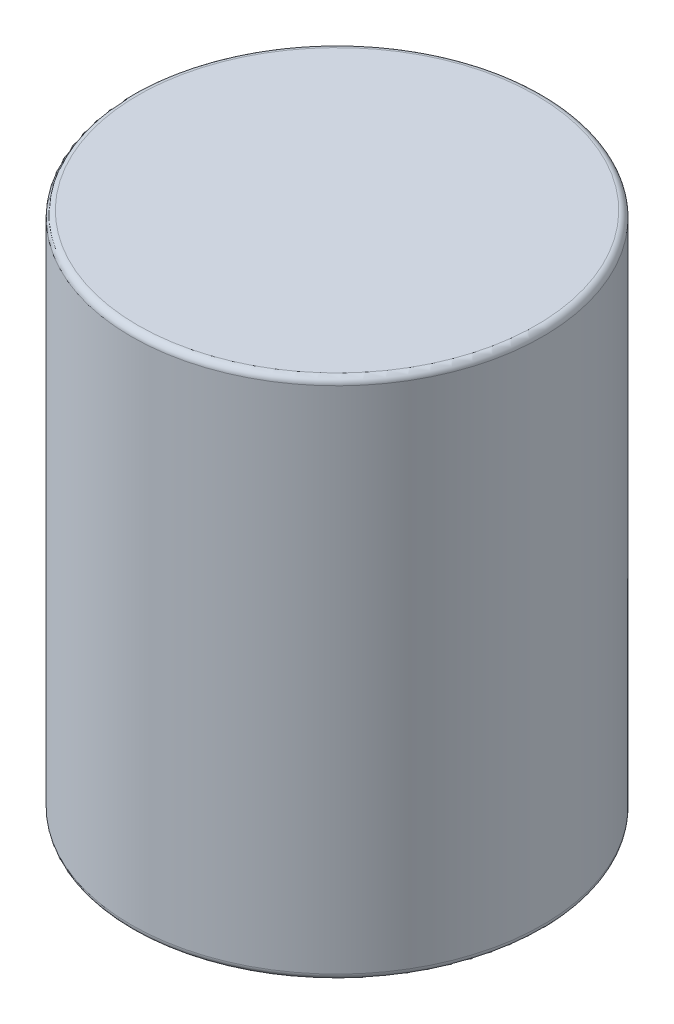
ISO-10303-21;
HEADER;
FILE_DESCRIPTION(('STEP AP214'),'2;1');
FILE_NAME('part.step','',(''),(''),'','','');
FILE_SCHEMA(('AUTOMOTIVE_DESIGN { 1 0 10303 214 1 1 1 1 }'));
ENDSEC;
DATA;
#1=APPLICATION_CONTEXT('core data for automotive mechanical design processes');
#2=APPLICATION_PROTOCOL_DEFINITION('international standard','automotive_design',2000,#1);
#3=PRODUCT_CONTEXT('',#1,'mechanical');
#4=PRODUCT('Part','Part','',(#3));
#5=PRODUCT_RELATED_PRODUCT_CATEGORY('part','',(#4));
#6=PRODUCT_DEFINITION_FORMATION('','',#4);
#7=PRODUCT_DEFINITION_CONTEXT('part definition',#1,'design');
#8=PRODUCT_DEFINITION('design','',#6,#7);
#9=PRODUCT_DEFINITION_SHAPE('','',#8);
#10=(LENGTH_UNIT() NAMED_UNIT(*) SI_UNIT(.MILLI.,.METRE.));
#11=(NAMED_UNIT(*) PLANE_ANGLE_UNIT() SI_UNIT($,.RADIAN.));
#12=(NAMED_UNIT(*) SI_UNIT($,.STERADIAN.) SOLID_ANGLE_UNIT());
#13=UNCERTAINTY_MEASURE_WITH_UNIT(LENGTH_MEASURE(1.E-05),#10,'distance_accuracy_value','');
#14=(GEOMETRIC_REPRESENTATION_CONTEXT(3) GLOBAL_UNCERTAINTY_ASSIGNED_CONTEXT((#13)) GLOBAL_UNIT_ASSIGNED_CONTEXT((#10,
#11,#12)) REPRESENTATION_CONTEXT('',''));
#15=CARTESIAN_POINT('',(0.,0.,0.));
#16=DIRECTION('',(0.,0.,1.));
#17=DIRECTION('',(1.,0.,0.));
#18=AXIS2_PLACEMENT_3D('',#15,#16,#17);
#19=CARTESIAN_POINT('',(0.,8.,0.));
#20=DIRECTION('',(0.,-1.,0.));
#21=DIRECTION('',(0.,0.,-1.));
#22=AXIS2_PLACEMENT_3D('',#19,#20,#21);
#23=CYLINDRICAL_SURFACE('',#22,3.15);
#24=CARTESIAN_POINT('',(0.,0.0999999999999994,0.));
#25=DIRECTION('',(0.,1.,0.));
#26=DIRECTION('',(0.,0.,1.));
#27=AXIS2_PLACEMENT_3D('',#24,#25,#26);
#28=CIRCLE('',#27,3.15);
#29=CARTESIAN_POINT('',(0.,0.0999999999999994,3.15));
#30=VERTEX_POINT('',#29);
#31=EDGE_CURVE('E42',#30,#30,#28,.T.);
#32=ORIENTED_EDGE('',*,*,#31,.T.);
#33=EDGE_LOOP('',(#32));
#34=FACE_BOUND('',#33,.T.);
#35=CARTESIAN_POINT('',(0.,7.9,0.));
#36=DIRECTION('',(0.,1.,0.));
#37=DIRECTION('',(0.,0.,1.));
#38=AXIS2_PLACEMENT_3D('',#35,#36,#37);
#39=CIRCLE('',#38,3.15);
#40=CARTESIAN_POINT('',(0.,7.9,3.15));
#41=VERTEX_POINT('',#40);
#42=EDGE_CURVE('E46',#41,#41,#39,.F.);
#43=ORIENTED_EDGE('',*,*,#42,.T.);
#44=EDGE_LOOP('',(#43));
#45=FACE_BOUND('',#44,.T.);
#46=ADVANCED_FACE('F35',(#34,#45),#23,.T.);
#47=CARTESIAN_POINT('',(0.,8.,0.));
#48=DIRECTION('',(0.,1.,0.));
#49=DIRECTION('',(0.,0.,1.));
#50=AXIS2_PLACEMENT_3D('',#47,#48,#49);
#51=PLANE('',#50);
#52=CARTESIAN_POINT('',(0.,8.,0.));
#53=DIRECTION('',(0.,1.,0.));
#54=DIRECTION('',(0.,0.,1.));
#55=AXIS2_PLACEMENT_3D('',#52,#53,#54);
#56=CIRCLE('',#55,3.05);
#57=CARTESIAN_POINT('',(0.,8.,3.05));
#58=VERTEX_POINT('',#57);
#59=EDGE_CURVE('E50',#58,#58,#56,.T.);
#60=ORIENTED_EDGE('',*,*,#59,.T.);
#61=EDGE_LOOP('',(#60));
#62=FACE_BOUND('',#61,.T.);
#63=ADVANCED_FACE('F56',(#62),#51,.T.);
#64=CARTESIAN_POINT('',(0.,0.,0.));
#65=DIRECTION('',(0.,1.,0.));
#66=DIRECTION('',(0.,0.,1.));
#67=AXIS2_PLACEMENT_3D('',#64,#65,#66);
#68=PLANE('',#67);
#69=CARTESIAN_POINT('',(0.,0.,0.));
#70=DIRECTION('',(0.,1.,0.));
#71=DIRECTION('',(0.,0.,1.));
#72=AXIS2_PLACEMENT_3D('',#69,#70,#71);
#73=CIRCLE('',#72,3.05);
#74=CARTESIAN_POINT('',(0.,0.,3.05));
#75=VERTEX_POINT('',#74);
#76=EDGE_CURVE('E10',#75,#75,#73,.F.);
#77=ORIENTED_EDGE('',*,*,#76,.T.);
#78=EDGE_LOOP('',(#77));
#79=FACE_BOUND('',#78,.T.);
#80=ADVANCED_FACE('F60',(#79),#68,.F.);
#81=CARTESIAN_POINT('',(0.,7.9,0.));
#82=DIRECTION('',(0.,1.,0.));
#83=DIRECTION('',(0.,0.,1.));
#84=AXIS2_PLACEMENT_3D('',#81,#82,#83);
#85=TOROIDAL_SURFACE('',#84,3.05,0.1);
#86=ORIENTED_EDGE('',*,*,#42,.F.);
#87=EDGE_LOOP('',(#86));
#88=FACE_BOUND('',#87,.T.);
#89=ORIENTED_EDGE('',*,*,#59,.F.);
#90=EDGE_LOOP('',(#89));
#91=FACE_BOUND('',#90,.T.);
#92=ADVANCED_FACE('F58',(#88,#91),#85,.T.);
#93=CARTESIAN_POINT('',(0.,0.0999999999999994,0.));
#94=DIRECTION('',(0.,1.,0.));
#95=DIRECTION('',(0.,0.,1.));
#96=AXIS2_PLACEMENT_3D('',#93,#94,#95);
#97=TOROIDAL_SURFACE('',#96,3.05,0.1);
#98=ORIENTED_EDGE('',*,*,#76,.F.);
#99=EDGE_LOOP('',(#98));
#100=FACE_BOUND('',#99,.T.);
#101=ORIENTED_EDGE('',*,*,#31,.F.);
#102=EDGE_LOOP('',(#101));
#103=FACE_BOUND('',#102,.T.);
#104=ADVANCED_FACE('F37',(#100,#103),#97,.T.);
#105=CLOSED_SHELL('',(#46,#63,#80,#92,#104));
#106=MANIFOLD_SOLID_BREP('B2',#105);
#107=ADVANCED_BREP_SHAPE_REPRESENTATION('',(#18,#106),#14);
#108=SHAPE_DEFINITION_REPRESENTATION(#9,#107);
ENDSEC;
END-ISO-10303-21;
